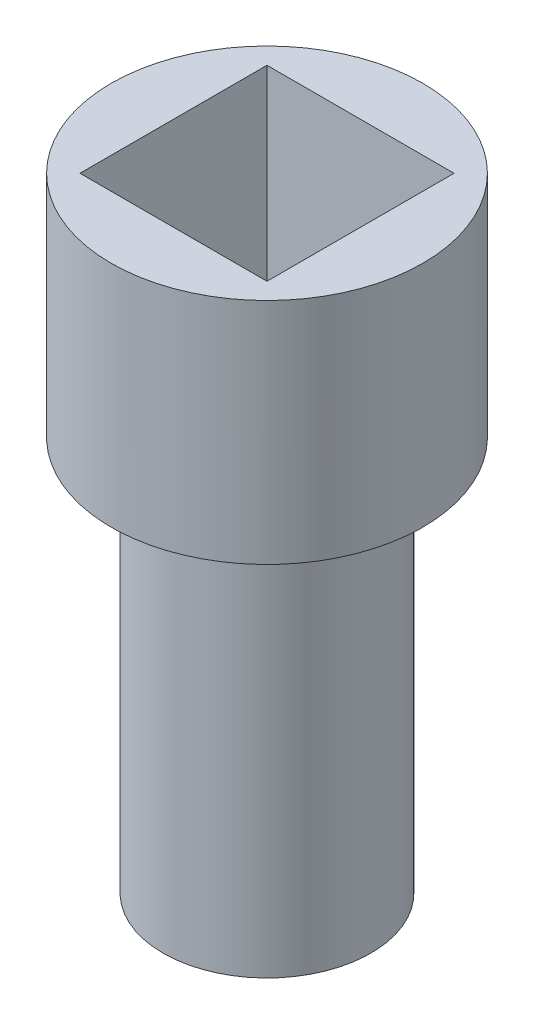
ISO-10303-21;
HEADER;
FILE_DESCRIPTION(('STEP AP214'),'2;1');
FILE_NAME('part.step','',(''),(''),'','','');
FILE_SCHEMA(('AUTOMOTIVE_DESIGN { 1 0 10303 214 1 1 1 1 }'));
ENDSEC;
DATA;
#1=APPLICATION_CONTEXT('core data for automotive mechanical design processes');
#2=APPLICATION_PROTOCOL_DEFINITION('international standard','automotive_design',2000,#1);
#3=PRODUCT_CONTEXT('',#1,'mechanical');
#4=PRODUCT('Part','Part','',(#3));
#5=PRODUCT_RELATED_PRODUCT_CATEGORY('part','',(#4));
#6=PRODUCT_DEFINITION_FORMATION('','',#4);
#7=PRODUCT_DEFINITION_CONTEXT('part definition',#1,'design');
#8=PRODUCT_DEFINITION('design','',#6,#7);
#9=PRODUCT_DEFINITION_SHAPE('','',#8);
#10=(LENGTH_UNIT() NAMED_UNIT(*) SI_UNIT(.MILLI.,.METRE.));
#11=(NAMED_UNIT(*) PLANE_ANGLE_UNIT() SI_UNIT($,.RADIAN.));
#12=(NAMED_UNIT(*) SI_UNIT($,.STERADIAN.) SOLID_ANGLE_UNIT());
#13=UNCERTAINTY_MEASURE_WITH_UNIT(LENGTH_MEASURE(1.E-05),#10,'distance_accuracy_value','');
#14=(GEOMETRIC_REPRESENTATION_CONTEXT(3) GLOBAL_UNCERTAINTY_ASSIGNED_CONTEXT((#13)) GLOBAL_UNIT_ASSIGNED_CONTEXT((#10,
#11,#12)) REPRESENTATION_CONTEXT('',''));
#15=CARTESIAN_POINT('',(0.,0.,0.));
#16=DIRECTION('',(0.,0.,1.));
#17=DIRECTION('',(1.,0.,0.));
#18=AXIS2_PLACEMENT_3D('',#15,#16,#17);
#19=CARTESIAN_POINT('',(0.,-20.,0.));
#20=DIRECTION('',(0.,1.,0.));
#21=DIRECTION('',(0.,0.,1.));
#22=AXIS2_PLACEMENT_3D('',#19,#20,#21);
#23=CYLINDRICAL_SURFACE('',#22,5.);
#24=CARTESIAN_POINT('',(0.,-1.,0.));
#25=DIRECTION('',(0.,-1.,0.));
#26=DIRECTION('',(0.,0.,-1.));
#27=AXIS2_PLACEMENT_3D('',#24,#25,#26);
#28=CIRCLE('',#27,5.);
#29=CARTESIAN_POINT('',(0.,-1.,-5.));
#30=VERTEX_POINT('',#29);
#31=EDGE_CURVE('E11',#30,#30,#28,.F.);
#32=ORIENTED_EDGE('',*,*,#31,.F.);
#33=EDGE_LOOP('',(#32));
#34=FACE_BOUND('',#33,.T.);
#35=CARTESIAN_POINT('',(0.,-20.,0.));
#36=DIRECTION('',(0.,1.,0.));
#37=DIRECTION('',(0.,0.,1.));
#38=AXIS2_PLACEMENT_3D('',#35,#36,#37);
#39=CIRCLE('',#38,5.);
#40=CARTESIAN_POINT('',(0.,-20.,5.));
#41=VERTEX_POINT('',#40);
#42=EDGE_CURVE('E100',#41,#41,#39,.T.);
#43=ORIENTED_EDGE('',*,*,#42,.T.);
#44=EDGE_LOOP('',(#43));
#45=FACE_BOUND('',#44,.T.);
#46=ADVANCED_FACE('F41',(#34,#45),#23,.T.);
#47=CARTESIAN_POINT('',(0.,-20.,0.));
#48=DIRECTION('',(0.,1.,0.));
#49=DIRECTION('',(0.,0.,1.));
#50=AXIS2_PLACEMENT_3D('',#47,#48,#49);
#51=PLANE('',#50);
#52=CARTESIAN_POINT('',(0.,-20.,0.));
#53=DIRECTION('',(0.,-1.,0.));
#54=DIRECTION('',(0.,0.,-1.));
#55=AXIS2_PLACEMENT_3D('',#52,#53,#54);
#56=CIRCLE('',#55,2.);
#57=CARTESIAN_POINT('',(0.,-20.,-2.));
#58=VERTEX_POINT('',#57);
#59=EDGE_CURVE('E138',#58,#58,#56,.T.);
#60=ORIENTED_EDGE('',*,*,#59,.F.);
#61=EDGE_LOOP('',(#60));
#62=FACE_BOUND('',#61,.T.);
#63=ORIENTED_EDGE('',*,*,#42,.F.);
#64=EDGE_LOOP('',(#63));
#65=FACE_BOUND('',#64,.T.);
#66=ADVANCED_FACE('F149',(#62,#65),#51,.F.);
#67=CARTESIAN_POINT('',(0.,-11.5,0.));
#68=DIRECTION('',(0.,-1.,0.));
#69=DIRECTION('',(0.,0.,-1.));
#70=AXIS2_PLACEMENT_3D('',#67,#68,#69);
#71=CYLINDRICAL_SURFACE('',#70,2.);
#72=CARTESIAN_POINT('',(0.,-11.5,0.));
#73=DIRECTION('',(0.,-1.,0.));
#74=DIRECTION('',(0.,0.,-1.));
#75=AXIS2_PLACEMENT_3D('',#72,#73,#74);
#76=CIRCLE('',#75,2.);
#77=CARTESIAN_POINT('',(0.,-11.5,-2.));
#78=VERTEX_POINT('',#77);
#79=EDGE_CURVE('E141',#78,#78,#76,.T.);
#80=ORIENTED_EDGE('',*,*,#79,.F.);
#81=EDGE_LOOP('',(#80));
#82=FACE_BOUND('',#81,.T.);
#83=ORIENTED_EDGE('',*,*,#59,.T.);
#84=EDGE_LOOP('',(#83));
#85=FACE_BOUND('',#84,.T.);
#86=ADVANCED_FACE('F151',(#82,#85),#71,.F.);
#87=CARTESIAN_POINT('',(0.,-11.5,0.));
#88=DIRECTION('',(0.,-1.,0.));
#89=DIRECTION('',(0.,0.,-1.));
#90=AXIS2_PLACEMENT_3D('',#87,#88,#89);
#91=PLANE('',#90);
#92=ORIENTED_EDGE('',*,*,#79,.T.);
#93=EDGE_LOOP('',(#92));
#94=FACE_BOUND('',#93,.T.);
#95=ADVANCED_FACE('F157',(#94),#91,.T.);
#96=CARTESIAN_POINT('',(0.,-1.,0.));
#97=DIRECTION('',(0.,-1.,0.));
#98=DIRECTION('',(0.,0.,-1.));
#99=AXIS2_PLACEMENT_3D('',#96,#97,#98);
#100=PLANE('',#99);
#101=ORIENTED_EDGE('',*,*,#31,.T.);
#102=EDGE_LOOP('',(#101));
#103=FACE_BOUND('',#102,.T.);
#104=CARTESIAN_POINT('',(0.,-1.,0.));
#105=DIRECTION('',(0.,-1.,0.));
#106=DIRECTION('',(0.,0.,-1.));
#107=AXIS2_PLACEMENT_3D('',#104,#105,#106);
#108=CIRCLE('',#107,7.50000000000002);
#109=CARTESIAN_POINT('',(0.,-1.,-7.50000000000002));
#110=VERTEX_POINT('',#109);
#111=EDGE_CURVE('E136',#110,#110,#108,.T.);
#112=ORIENTED_EDGE('',*,*,#111,.T.);
#113=EDGE_LOOP('',(#112));
#114=FACE_BOUND('',#113,.T.);
#115=ADVANCED_FACE('F167',(#103,#114),#100,.T.);
#116=CARTESIAN_POINT('',(0.,0.,0.));
#117=DIRECTION('',(0.,1.,0.));
#118=DIRECTION('',(0.,0.,1.));
#119=AXIS2_PLACEMENT_3D('',#116,#117,#118);
#120=PLANE('',#119);
#121=DIRECTION('',(0.,0.,-1.));
#122=VECTOR('',#121,1.);
#123=CARTESIAN_POINT('',(4.5,0.,0.));
#124=LINE('',#123,#122);
#125=CARTESIAN_POINT('',(4.5,0.,4.5));
#126=VERTEX_POINT('',#125);
#127=CARTESIAN_POINT('',(4.5,0.,-4.5));
#128=VERTEX_POINT('',#127);
#129=EDGE_CURVE('E96',#126,#128,#124,.T.);
#130=ORIENTED_EDGE('',*,*,#129,.T.);
#131=DIRECTION('',(1.,0.,0.));
#132=VECTOR('',#131,1.);
#133=CARTESIAN_POINT('',(0.,0.,-4.5));
#134=LINE('',#133,#132);
#135=CARTESIAN_POINT('',(-4.5,0.,-4.5));
#136=VERTEX_POINT('',#135);
#137=EDGE_CURVE('E93',#136,#128,#134,.T.);
#138=ORIENTED_EDGE('',*,*,#137,.F.);
#139=DIRECTION('',(0.,0.,-1.));
#140=VECTOR('',#139,1.);
#141=CARTESIAN_POINT('',(-4.5,0.,0.));
#142=LINE('',#141,#140);
#143=CARTESIAN_POINT('',(-4.5,0.,4.5));
#144=VERTEX_POINT('',#143);
#145=EDGE_CURVE('E82',#144,#136,#142,.T.);
#146=ORIENTED_EDGE('',*,*,#145,.F.);
#147=DIRECTION('',(1.,0.,0.));
#148=VECTOR('',#147,1.);
#149=CARTESIAN_POINT('',(0.,0.,4.5));
#150=LINE('',#149,#148);
#151=EDGE_CURVE('E90',#144,#126,#150,.T.);
#152=ORIENTED_EDGE('',*,*,#151,.T.);
#153=EDGE_LOOP('',(#130,#138,#146,#152));
#154=FACE_BOUND('',#153,.T.);
#155=ADVANCED_FACE('F94',(#154),#120,.T.);
#156=CARTESIAN_POINT('',(-4.5,10.,0.));
#157=DIRECTION('',(-1.,0.,0.));
#158=DIRECTION('',(0.,0.,1.));
#159=AXIS2_PLACEMENT_3D('',#156,#157,#158);
#160=PLANE('',#159);
#161=ORIENTED_EDGE('',*,*,#145,.T.);
#162=DIRECTION('',(0.,-1.,0.));
#163=VECTOR('',#162,1.);
#164=CARTESIAN_POINT('',(-4.5,10.,-4.5));
#165=LINE('',#164,#163);
#166=CARTESIAN_POINT('',(-4.5,10.,-4.5));
#167=VERTEX_POINT('',#166);
#168=EDGE_CURVE('E86',#167,#136,#165,.T.);
#169=ORIENTED_EDGE('',*,*,#168,.F.);
#170=DIRECTION('',(0.,0.,-1.));
#171=VECTOR('',#170,1.);
#172=CARTESIAN_POINT('',(-4.5,10.,0.));
#173=LINE('',#172,#171);
#174=CARTESIAN_POINT('',(-4.5,10.,4.5));
#175=VERTEX_POINT('',#174);
#176=EDGE_CURVE('E56',#175,#167,#173,.T.);
#177=ORIENTED_EDGE('',*,*,#176,.F.);
#178=DIRECTION('',(0.,-1.,0.));
#179=VECTOR('',#178,1.);
#180=CARTESIAN_POINT('',(-4.5,10.,4.5));
#181=LINE('',#180,#179);
#182=EDGE_CURVE('E64',#175,#144,#181,.T.);
#183=ORIENTED_EDGE('',*,*,#182,.T.);
#184=EDGE_LOOP('',(#161,#169,#177,#183));
#185=FACE_BOUND('',#184,.T.);
#186=ADVANCED_FACE('F84',(#185),#160,.F.);
#187=CARTESIAN_POINT('',(0.,10.,4.5));
#188=DIRECTION('',(0.,0.,-1.));
#189=DIRECTION('',(-1.,0.,0.));
#190=AXIS2_PLACEMENT_3D('',#187,#188,#189);
#191=PLANE('',#190);
#192=ORIENTED_EDGE('',*,*,#151,.F.);
#193=ORIENTED_EDGE('',*,*,#182,.F.);
#194=DIRECTION('',(1.,0.,0.));
#195=VECTOR('',#194,1.);
#196=CARTESIAN_POINT('',(0.,10.,4.5));
#197=LINE('',#196,#195);
#198=CARTESIAN_POINT('',(4.5,10.,4.5));
#199=VERTEX_POINT('',#198);
#200=EDGE_CURVE('E116',#175,#199,#197,.T.);
#201=ORIENTED_EDGE('',*,*,#200,.T.);
#202=DIRECTION('',(0.,-1.,0.));
#203=VECTOR('',#202,1.);
#204=CARTESIAN_POINT('',(4.5,10.,4.5));
#205=LINE('',#204,#203);
#206=EDGE_CURVE('E104',#199,#126,#205,.T.);
#207=ORIENTED_EDGE('',*,*,#206,.T.);
#208=EDGE_LOOP('',(#192,#193,#201,#207));
#209=FACE_BOUND('',#208,.T.);
#210=ADVANCED_FACE('F123',(#209),#191,.T.);
#211=CARTESIAN_POINT('',(4.5,10.,0.));
#212=DIRECTION('',(-1.,0.,0.));
#213=DIRECTION('',(0.,0.,1.));
#214=AXIS2_PLACEMENT_3D('',#211,#212,#213);
#215=PLANE('',#214);
#216=ORIENTED_EDGE('',*,*,#129,.F.);
#217=ORIENTED_EDGE('',*,*,#206,.F.);
#218=DIRECTION('',(0.,0.,-1.));
#219=VECTOR('',#218,1.);
#220=CARTESIAN_POINT('',(4.5,10.,0.));
#221=LINE('',#220,#219);
#222=CARTESIAN_POINT('',(4.5,10.,-4.5));
#223=VERTEX_POINT('',#222);
#224=EDGE_CURVE('E115',#199,#223,#221,.T.);
#225=ORIENTED_EDGE('',*,*,#224,.T.);
#226=DIRECTION('',(0.,-1.,0.));
#227=VECTOR('',#226,1.);
#228=CARTESIAN_POINT('',(4.5,10.,-4.5));
#229=LINE('',#228,#227);
#230=EDGE_CURVE('E49',#223,#128,#229,.T.);
#231=ORIENTED_EDGE('',*,*,#230,.T.);
#232=EDGE_LOOP('',(#216,#217,#225,#231));
#233=FACE_BOUND('',#232,.T.);
#234=ADVANCED_FACE('F113',(#233),#215,.T.);
#235=CARTESIAN_POINT('',(0.,10.,-4.5));
#236=DIRECTION('',(0.,0.,-1.));
#237=DIRECTION('',(-1.,0.,0.));
#238=AXIS2_PLACEMENT_3D('',#235,#236,#237);
#239=PLANE('',#238);
#240=ORIENTED_EDGE('',*,*,#137,.T.);
#241=ORIENTED_EDGE('',*,*,#230,.F.);
#242=DIRECTION('',(1.,0.,0.));
#243=VECTOR('',#242,1.);
#244=CARTESIAN_POINT('',(0.,10.,-4.5));
#245=LINE('',#244,#243);
#246=EDGE_CURVE('E89',#167,#223,#245,.T.);
#247=ORIENTED_EDGE('',*,*,#246,.F.);
#248=ORIENTED_EDGE('',*,*,#168,.T.);
#249=EDGE_LOOP('',(#240,#241,#247,#248));
#250=FACE_BOUND('',#249,.T.);
#251=ADVANCED_FACE('F43',(#250),#239,.F.);
#252=CARTESIAN_POINT('',(0.,10.,0.));
#253=DIRECTION('',(0.,1.,0.));
#254=DIRECTION('',(0.,0.,1.));
#255=AXIS2_PLACEMENT_3D('',#252,#253,#254);
#256=PLANE('',#255);
#257=ORIENTED_EDGE('',*,*,#246,.T.);
#258=ORIENTED_EDGE('',*,*,#224,.F.);
#259=ORIENTED_EDGE('',*,*,#200,.F.);
#260=ORIENTED_EDGE('',*,*,#176,.T.);
#261=EDGE_LOOP('',(#257,#258,#259,#260));
#262=FACE_BOUND('',#261,.T.);
#263=CARTESIAN_POINT('',(0.,10.,0.));
#264=DIRECTION('',(0.,1.,0.));
#265=DIRECTION('',(0.,0.,1.));
#266=AXIS2_PLACEMENT_3D('',#263,#264,#265);
#267=CIRCLE('',#266,7.50000000000002);
#268=CARTESIAN_POINT('',(0.,10.,7.50000000000002));
#269=VERTEX_POINT('',#268);
#270=EDGE_CURVE('E102',#269,#269,#267,.T.);
#271=ORIENTED_EDGE('',*,*,#270,.T.);
#272=EDGE_LOOP('',(#271));
#273=FACE_BOUND('',#272,.T.);
#274=ADVANCED_FACE('F124',(#262,#273),#256,.T.);
#275=CARTESIAN_POINT('',(0.,10.,0.));
#276=DIRECTION('',(0.,-1.,0.));
#277=DIRECTION('',(0.,0.,-1.));
#278=AXIS2_PLACEMENT_3D('',#275,#276,#277);
#279=CYLINDRICAL_SURFACE('',#278,7.50000000000002);
#280=ORIENTED_EDGE('',*,*,#270,.F.);
#281=EDGE_LOOP('',(#280));
#282=FACE_BOUND('',#281,.T.);
#283=ORIENTED_EDGE('',*,*,#111,.F.);
#284=EDGE_LOOP('',(#283));
#285=FACE_BOUND('',#284,.T.);
#286=ADVANCED_FACE('F127',(#282,#285),#279,.T.);
#287=CLOSED_SHELL('',(#46,#66,#86,#95,#115,#155,#186,#210,#234,#251,#274,#286));
#288=MANIFOLD_SOLID_BREP('B2',#287);
#289=ADVANCED_BREP_SHAPE_REPRESENTATION('',(#18,#288),#14);
#290=SHAPE_DEFINITION_REPRESENTATION(#9,#289);
ENDSEC;
END-ISO-10303-21;
